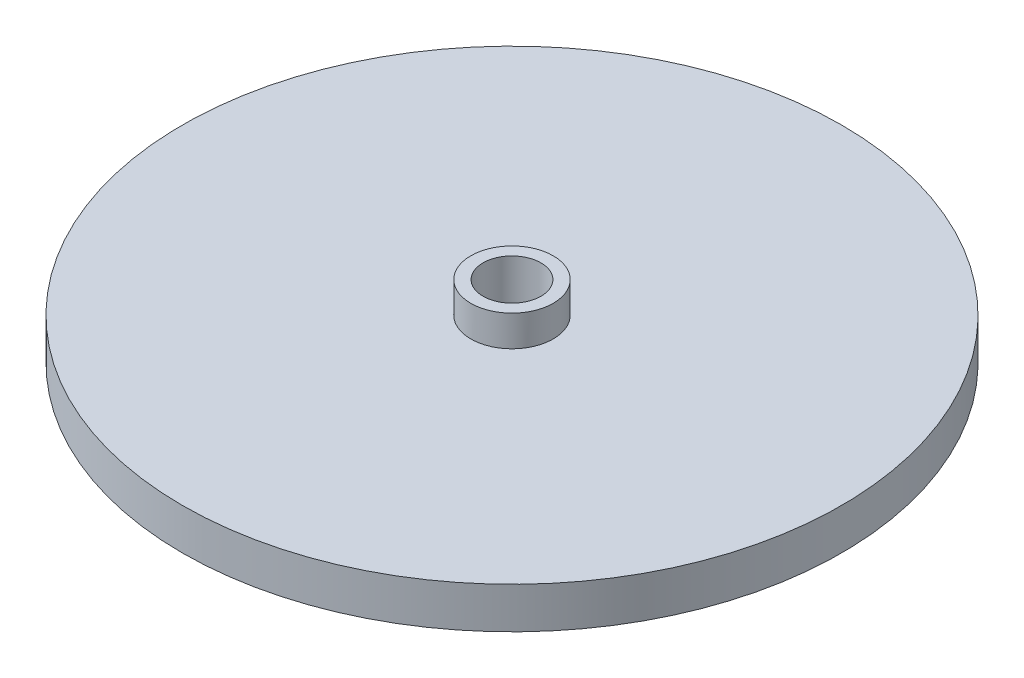
ISO-10303-21;
HEADER;
FILE_DESCRIPTION(('STEP AP214'),'2;1');
FILE_NAME('part.step','',(''),(''),'','','');
FILE_SCHEMA(('AUTOMOTIVE_DESIGN { 1 0 10303 214 1 1 1 1 }'));
ENDSEC;
DATA;
#1=APPLICATION_CONTEXT('core data for automotive mechanical design processes');
#2=APPLICATION_PROTOCOL_DEFINITION('international standard','automotive_design',2000,#1);
#3=PRODUCT_CONTEXT('',#1,'mechanical');
#4=PRODUCT('Part','Part','',(#3));
#5=PRODUCT_RELATED_PRODUCT_CATEGORY('part','',(#4));
#6=PRODUCT_DEFINITION_FORMATION('','',#4);
#7=PRODUCT_DEFINITION_CONTEXT('part definition',#1,'design');
#8=PRODUCT_DEFINITION('design','',#6,#7);
#9=PRODUCT_DEFINITION_SHAPE('','',#8);
#10=(LENGTH_UNIT() NAMED_UNIT(*) SI_UNIT(.MILLI.,.METRE.));
#11=(NAMED_UNIT(*) PLANE_ANGLE_UNIT() SI_UNIT($,.RADIAN.));
#12=(NAMED_UNIT(*) SI_UNIT($,.STERADIAN.) SOLID_ANGLE_UNIT());
#13=UNCERTAINTY_MEASURE_WITH_UNIT(LENGTH_MEASURE(1.E-05),#10,'distance_accuracy_value','');
#14=(GEOMETRIC_REPRESENTATION_CONTEXT(3) GLOBAL_UNCERTAINTY_ASSIGNED_CONTEXT((#13)) GLOBAL_UNIT_ASSIGNED_CONTEXT((#10,
#11,#12)) REPRESENTATION_CONTEXT('',''));
#15=CARTESIAN_POINT('',(0.,0.,0.));
#16=DIRECTION('',(0.,0.,1.));
#17=DIRECTION('',(1.,0.,0.));
#18=AXIS2_PLACEMENT_3D('',#15,#16,#17);
#19=CARTESIAN_POINT('',(-101.6,0.,0.));
#20=DIRECTION('',(0.,-1.,0.));
#21=DIRECTION('',(0.,0.,-1.));
#22=AXIS2_PLACEMENT_3D('',#19,#20,#21);
#23=PLANE('',#22);
#24=CARTESIAN_POINT('',(0.,0.,0.));
#25=DIRECTION('',(0.,-1.,0.));
#26=DIRECTION('',(0.,0.,-1.));
#27=AXIS2_PLACEMENT_3D('',#24,#25,#26);
#28=CIRCLE('',#27,12.7);
#29=CARTESIAN_POINT('',(0.,0.,-12.7));
#30=VERTEX_POINT('',#29);
#31=EDGE_CURVE('E10',#30,#30,#28,.F.);
#32=ORIENTED_EDGE('',*,*,#31,.F.);
#33=EDGE_LOOP('',(#32));
#34=FACE_BOUND('',#33,.T.);
#35=CARTESIAN_POINT('',(0.,0.,0.));
#36=DIRECTION('',(0.,-1.,0.));
#37=DIRECTION('',(0.,0.,-1.));
#38=AXIS2_PLACEMENT_3D('',#35,#36,#37);
#39=CIRCLE('',#38,101.6);
#40=CARTESIAN_POINT('',(0.,0.,-101.6));
#41=VERTEX_POINT('',#40);
#42=EDGE_CURVE('E38',#41,#41,#39,.T.);
#43=ORIENTED_EDGE('',*,*,#42,.F.);
#44=EDGE_LOOP('',(#43));
#45=FACE_BOUND('',#44,.T.);
#46=ADVANCED_FACE('F32',(#34,#45),#23,.F.);
#47=CARTESIAN_POINT('',(0.,-6.35,0.));
#48=DIRECTION('',(0.,-1.,0.));
#49=DIRECTION('',(0.,0.,-1.));
#50=AXIS2_PLACEMENT_3D('',#47,#48,#49);
#51=CYLINDRICAL_SURFACE('',#50,101.6);
#52=CARTESIAN_POINT('',(0.,-12.7,0.));
#53=DIRECTION('',(0.,-1.,0.));
#54=DIRECTION('',(0.,0.,-1.));
#55=AXIS2_PLACEMENT_3D('',#52,#53,#54);
#56=CIRCLE('',#55,101.6);
#57=CARTESIAN_POINT('',(0.,-12.7,-101.6));
#58=VERTEX_POINT('',#57);
#59=EDGE_CURVE('E42',#58,#58,#56,.T.);
#60=ORIENTED_EDGE('',*,*,#59,.F.);
#61=EDGE_LOOP('',(#60));
#62=FACE_BOUND('',#61,.T.);
#63=ORIENTED_EDGE('',*,*,#42,.T.);
#64=EDGE_LOOP('',(#63));
#65=FACE_BOUND('',#64,.T.);
#66=ADVANCED_FACE('F96',(#62,#65),#51,.T.);
#67=CARTESIAN_POINT('',(-101.6,-12.7,0.));
#68=DIRECTION('',(0.,1.,0.));
#69=DIRECTION('',(0.,0.,1.));
#70=AXIS2_PLACEMENT_3D('',#67,#68,#69);
#71=PLANE('',#70);
#72=CARTESIAN_POINT('',(0.,-12.7,0.));
#73=DIRECTION('',(0.,-1.,0.));
#74=DIRECTION('',(0.,0.,-1.));
#75=AXIS2_PLACEMENT_3D('',#72,#73,#74);
#76=CIRCLE('',#75,48.8212810658207);
#77=CARTESIAN_POINT('',(0.,-12.7,-48.8212810658207));
#78=VERTEX_POINT('',#77);
#79=EDGE_CURVE('E46',#78,#78,#76,.T.);
#80=ORIENTED_EDGE('',*,*,#79,.F.);
#81=EDGE_LOOP('',(#80));
#82=FACE_BOUND('',#81,.T.);
#83=ORIENTED_EDGE('',*,*,#59,.T.);
#84=EDGE_LOOP('',(#83));
#85=FACE_BOUND('',#84,.T.);
#86=ADVANCED_FACE('F101',(#82,#85),#71,.F.);
#87=CARTESIAN_POINT('',(0.,-6.35,0.));
#88=DIRECTION('',(0.,-1.,0.));
#89=DIRECTION('',(0.,0.,-1.));
#90=AXIS2_PLACEMENT_3D('',#87,#88,#89);
#91=CYLINDRICAL_SURFACE('',#90,48.8212810658207);
#92=CARTESIAN_POINT('',(0.,-10.922,0.));
#93=DIRECTION('',(0.,-1.,0.));
#94=DIRECTION('',(0.,0.,-1.));
#95=AXIS2_PLACEMENT_3D('',#92,#93,#94);
#96=CIRCLE('',#95,48.8212810658207);
#97=CARTESIAN_POINT('',(0.,-10.922,-48.8212810658207));
#98=VERTEX_POINT('',#97);
#99=EDGE_CURVE('E51',#98,#98,#96,.T.);
#100=ORIENTED_EDGE('',*,*,#99,.F.);
#101=EDGE_LOOP('',(#100));
#102=FACE_BOUND('',#101,.T.);
#103=ORIENTED_EDGE('',*,*,#79,.T.);
#104=EDGE_LOOP('',(#103));
#105=FACE_BOUND('',#104,.T.);
#106=ADVANCED_FACE('F107',(#102,#105),#91,.F.);
#107=CARTESIAN_POINT('',(-46.2812810658207,-10.922,0.));
#108=DIRECTION('',(0.,1.,0.));
#109=DIRECTION('',(0.,0.,1.));
#110=AXIS2_PLACEMENT_3D('',#107,#108,#109);
#111=PLANE('',#110);
#112=CARTESIAN_POINT('',(0.,-10.922,0.));
#113=DIRECTION('',(0.,-1.,0.));
#114=DIRECTION('',(0.,0.,-1.));
#115=AXIS2_PLACEMENT_3D('',#112,#113,#114);
#116=CIRCLE('',#115,46.2812810658207);
#117=CARTESIAN_POINT('',(0.,-10.922,-46.2812810658207));
#118=VERTEX_POINT('',#117);
#119=EDGE_CURVE('E54',#118,#118,#116,.T.);
#120=ORIENTED_EDGE('',*,*,#119,.F.);
#121=EDGE_LOOP('',(#120));
#122=FACE_BOUND('',#121,.T.);
#123=ORIENTED_EDGE('',*,*,#99,.T.);
#124=EDGE_LOOP('',(#123));
#125=FACE_BOUND('',#124,.T.);
#126=ADVANCED_FACE('F114',(#122,#125),#111,.F.);
#127=CARTESIAN_POINT('',(0.,-6.35,0.));
#128=DIRECTION('',(0.,-1.,0.));
#129=DIRECTION('',(0.,0.,-1.));
#130=AXIS2_PLACEMENT_3D('',#127,#128,#129);
#131=CYLINDRICAL_SURFACE('',#130,46.2812810658207);
#132=CARTESIAN_POINT('',(0.,-12.7,0.));
#133=DIRECTION('',(0.,-1.,0.));
#134=DIRECTION('',(0.,0.,-1.));
#135=AXIS2_PLACEMENT_3D('',#132,#133,#134);
#136=CIRCLE('',#135,46.2812810658207);
#137=CARTESIAN_POINT('',(0.,-12.7,-46.2812810658207));
#138=VERTEX_POINT('',#137);
#139=EDGE_CURVE('E57',#138,#138,#136,.T.);
#140=ORIENTED_EDGE('',*,*,#139,.F.);
#141=EDGE_LOOP('',(#140));
#142=FACE_BOUND('',#141,.T.);
#143=ORIENTED_EDGE('',*,*,#119,.T.);
#144=EDGE_LOOP('',(#143));
#145=FACE_BOUND('',#144,.T.);
#146=ADVANCED_FACE('F118',(#142,#145),#131,.T.);
#147=CARTESIAN_POINT('',(-46.2812810658207,-12.7,0.));
#148=DIRECTION('',(0.,1.,0.));
#149=DIRECTION('',(0.,0.,1.));
#150=AXIS2_PLACEMENT_3D('',#147,#148,#149);
#151=PLANE('',#150);
#152=CARTESIAN_POINT('',(0.,-12.7,0.));
#153=DIRECTION('',(0.,-1.,0.));
#154=DIRECTION('',(0.,0.,-1.));
#155=AXIS2_PLACEMENT_3D('',#152,#153,#154);
#156=CIRCLE('',#155,44.45);
#157=CARTESIAN_POINT('',(0.,-12.7,-44.45));
#158=VERTEX_POINT('',#157);
#159=EDGE_CURVE('E60',#158,#158,#156,.T.);
#160=ORIENTED_EDGE('',*,*,#159,.F.);
#161=EDGE_LOOP('',(#160));
#162=FACE_BOUND('',#161,.T.);
#163=ORIENTED_EDGE('',*,*,#139,.T.);
#164=EDGE_LOOP('',(#163));
#165=FACE_BOUND('',#164,.T.);
#166=ADVANCED_FACE('F122',(#162,#165),#151,.F.);
#167=CARTESIAN_POINT('',(0.,-6.35,0.));
#168=DIRECTION('',(0.,-1.,0.));
#169=DIRECTION('',(0.,0.,-1.));
#170=AXIS2_PLACEMENT_3D('',#167,#168,#169);
#171=CYLINDRICAL_SURFACE('',#170,44.45);
#172=CARTESIAN_POINT('',(0.,-6.35,0.));
#173=DIRECTION('',(0.,-1.,0.));
#174=DIRECTION('',(0.,0.,-1.));
#175=AXIS2_PLACEMENT_3D('',#172,#173,#174);
#176=CIRCLE('',#175,44.45);
#177=CARTESIAN_POINT('',(0.,-6.35,-44.45));
#178=VERTEX_POINT('',#177);
#179=EDGE_CURVE('E63',#178,#178,#176,.T.);
#180=ORIENTED_EDGE('',*,*,#179,.F.);
#181=EDGE_LOOP('',(#180));
#182=FACE_BOUND('',#181,.T.);
#183=ORIENTED_EDGE('',*,*,#159,.T.);
#184=EDGE_LOOP('',(#183));
#185=FACE_BOUND('',#184,.T.);
#186=ADVANCED_FACE('F92',(#182,#185),#171,.F.);
#187=CARTESIAN_POINT('',(-44.45,-6.35,0.));
#188=DIRECTION('',(0.,1.,0.));
#189=DIRECTION('',(0.,0.,1.));
#190=AXIS2_PLACEMENT_3D('',#187,#188,#189);
#191=PLANE('',#190);
#192=CARTESIAN_POINT('',(0.,-6.35,0.));
#193=DIRECTION('',(0.,1.,0.));
#194=DIRECTION('',(0.,0.,1.));
#195=AXIS2_PLACEMENT_3D('',#192,#193,#194);
#196=CIRCLE('',#195,8.92809999999999);
#197=CARTESIAN_POINT('',(0.,-6.35,8.92809999999999));
#198=VERTEX_POINT('',#197);
#199=EDGE_CURVE('E69',#198,#198,#196,.T.);
#200=ORIENTED_EDGE('',*,*,#199,.T.);
#201=EDGE_LOOP('',(#200));
#202=FACE_BOUND('',#201,.T.);
#203=ORIENTED_EDGE('',*,*,#179,.T.);
#204=EDGE_LOOP('',(#203));
#205=FACE_BOUND('',#204,.T.);
#206=ADVANCED_FACE('F87',(#202,#205),#191,.F.);
#207=CARTESIAN_POINT('',(0.,9.525,0.));
#208=DIRECTION('',(0.,-1.,0.));
#209=DIRECTION('',(0.,0.,-1.));
#210=AXIS2_PLACEMENT_3D('',#207,#208,#209);
#211=CYLINDRICAL_SURFACE('',#210,12.7);
#212=CARTESIAN_POINT('',(0.,9.525,0.));
#213=DIRECTION('',(0.,1.,0.));
#214=DIRECTION('',(0.,0.,1.));
#215=AXIS2_PLACEMENT_3D('',#212,#213,#214);
#216=CIRCLE('',#215,12.7);
#217=CARTESIAN_POINT('',(0.,9.525,12.7));
#218=VERTEX_POINT('',#217);
#219=EDGE_CURVE('E66',#218,#218,#216,.T.);
#220=ORIENTED_EDGE('',*,*,#219,.F.);
#221=EDGE_LOOP('',(#220));
#222=FACE_BOUND('',#221,.T.);
#223=ORIENTED_EDGE('',*,*,#31,.T.);
#224=EDGE_LOOP('',(#223));
#225=FACE_BOUND('',#224,.T.);
#226=ADVANCED_FACE('F82',(#222,#225),#211,.T.);
#227=CARTESIAN_POINT('',(0.,9.525,0.));
#228=DIRECTION('',(0.,1.,0.));
#229=DIRECTION('',(0.,0.,1.));
#230=AXIS2_PLACEMENT_3D('',#227,#228,#229);
#231=PLANE('',#230);
#232=CARTESIAN_POINT('',(0.,9.525,0.));
#233=DIRECTION('',(0.,1.,0.));
#234=DIRECTION('',(0.,0.,1.));
#235=AXIS2_PLACEMENT_3D('',#232,#233,#234);
#236=CIRCLE('',#235,8.92809999999999);
#237=CARTESIAN_POINT('',(0.,9.525,8.92809999999999));
#238=VERTEX_POINT('',#237);
#239=EDGE_CURVE('E72',#238,#238,#236,.T.);
#240=ORIENTED_EDGE('',*,*,#239,.F.);
#241=EDGE_LOOP('',(#240));
#242=FACE_BOUND('',#241,.T.);
#243=ORIENTED_EDGE('',*,*,#219,.T.);
#244=EDGE_LOOP('',(#243));
#245=FACE_BOUND('',#244,.T.);
#246=ADVANCED_FACE('F79',(#242,#245),#231,.T.);
#247=CARTESIAN_POINT('',(0.,9.525,0.));
#248=DIRECTION('',(0.,1.,0.));
#249=DIRECTION('',(0.,0.,1.));
#250=AXIS2_PLACEMENT_3D('',#247,#248,#249);
#251=CYLINDRICAL_SURFACE('',#250,8.92809999999999);
#252=ORIENTED_EDGE('',*,*,#239,.T.);
#253=EDGE_LOOP('',(#252));
#254=FACE_BOUND('',#253,.T.);
#255=ORIENTED_EDGE('',*,*,#199,.F.);
#256=EDGE_LOOP('',(#255));
#257=FACE_BOUND('',#256,.T.);
#258=ADVANCED_FACE('F76',(#254,#257),#251,.F.);
#259=CLOSED_SHELL('',(#46,#66,#86,#106,#126,#146,#166,#186,#206,#226,#246,#258));
#260=MANIFOLD_SOLID_BREP('B2',#259);
#261=ADVANCED_BREP_SHAPE_REPRESENTATION('',(#18,#260),#14);
#262=SHAPE_DEFINITION_REPRESENTATION(#9,#261);
ENDSEC;
END-ISO-10303-21;
